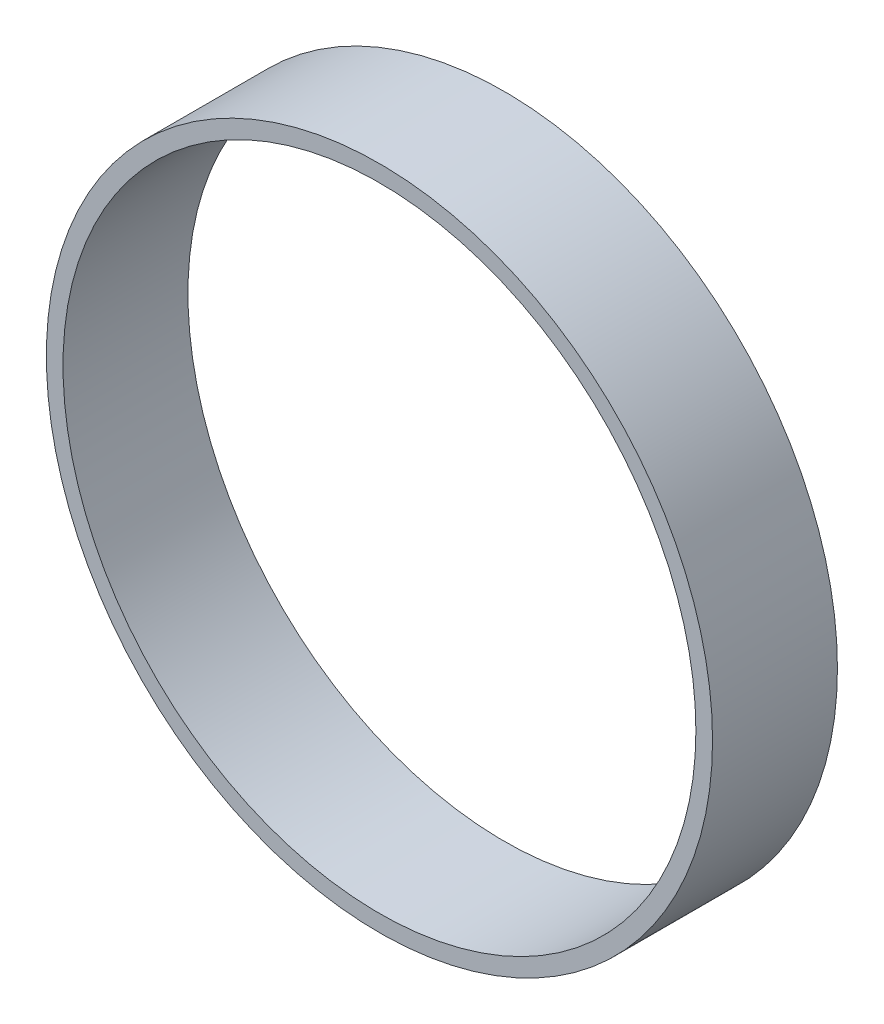
ISO-10303-21;
HEADER;
FILE_DESCRIPTION(('STEP AP214'),'2;1');
FILE_NAME('part.step','',(''),(''),'','','');
FILE_SCHEMA(('AUTOMOTIVE_DESIGN { 1 0 10303 214 1 1 1 1 }'));
ENDSEC;
DATA;
#1=APPLICATION_CONTEXT('core data for automotive mechanical design processes');
#2=APPLICATION_PROTOCOL_DEFINITION('international standard','automotive_design',2000,#1);
#3=PRODUCT_CONTEXT('',#1,'mechanical');
#4=PRODUCT('Part','Part','',(#3));
#5=PRODUCT_RELATED_PRODUCT_CATEGORY('part','',(#4));
#6=PRODUCT_DEFINITION_FORMATION('','',#4);
#7=PRODUCT_DEFINITION_CONTEXT('part definition',#1,'design');
#8=PRODUCT_DEFINITION('design','',#6,#7);
#9=PRODUCT_DEFINITION_SHAPE('','',#8);
#10=(LENGTH_UNIT() NAMED_UNIT(*) SI_UNIT(.MILLI.,.METRE.));
#11=(NAMED_UNIT(*) PLANE_ANGLE_UNIT() SI_UNIT($,.RADIAN.));
#12=(NAMED_UNIT(*) SI_UNIT($,.STERADIAN.) SOLID_ANGLE_UNIT());
#13=UNCERTAINTY_MEASURE_WITH_UNIT(LENGTH_MEASURE(1.E-05),#10,'distance_accuracy_value','');
#14=(GEOMETRIC_REPRESENTATION_CONTEXT(3) GLOBAL_UNCERTAINTY_ASSIGNED_CONTEXT((#13)) GLOBAL_UNIT_ASSIGNED_CONTEXT((#10,
#11,#12)) REPRESENTATION_CONTEXT('',''));
#15=CARTESIAN_POINT('',(0.,0.,0.));
#16=DIRECTION('',(0.,0.,1.));
#17=DIRECTION('',(1.,0.,0.));
#18=AXIS2_PLACEMENT_3D('',#15,#16,#17);
#19=CARTESIAN_POINT('',(1.4210854715202E-11,1.4210854715202E-11,15000.));
#20=DIRECTION('',(0.,0.,1.));
#21=DIRECTION('',(1.,0.,0.));
#22=AXIS2_PLACEMENT_3D('',#19,#20,#21);
#23=PLANE('',#22);
#24=CARTESIAN_POINT('',(1.4210854715202E-11,1.4210854715202E-11,15000.));
#25=DIRECTION('',(0.,0.,1.));
#26=DIRECTION('',(1.,0.,0.));
#27=AXIS2_PLACEMENT_3D('',#24,#25,#26);
#28=CIRCLE('',#27,40000.);
#29=CARTESIAN_POINT('',(40000.,1.4210854715202E-11,15000.));
#30=VERTEX_POINT('',#29);
#31=EDGE_CURVE('E10',#30,#30,#28,.T.);
#32=ORIENTED_EDGE('',*,*,#31,.T.);
#33=EDGE_LOOP('',(#32));
#34=FACE_BOUND('',#33,.T.);
#35=CARTESIAN_POINT('',(1.4210854715202E-11,1.4210854715202E-11,15000.));
#36=DIRECTION('',(0.,0.,1.));
#37=DIRECTION('',(1.,0.,0.));
#38=AXIS2_PLACEMENT_3D('',#35,#36,#37);
#39=CIRCLE('',#38,38000.);
#40=CARTESIAN_POINT('',(38000.,1.4210854715202E-11,15000.));
#41=VERTEX_POINT('',#40);
#42=EDGE_CURVE('E54',#41,#41,#39,.T.);
#43=ORIENTED_EDGE('',*,*,#42,.F.);
#44=EDGE_LOOP('',(#43));
#45=FACE_BOUND('',#44,.T.);
#46=ADVANCED_FACE('F41',(#34,#45),#23,.T.);
#47=CARTESIAN_POINT('',(1.4210854715202E-11,1.4210854715202E-11,0.));
#48=DIRECTION('',(0.,0.,1.));
#49=DIRECTION('',(1.,0.,0.));
#50=AXIS2_PLACEMENT_3D('',#47,#48,#49);
#51=PLANE('',#50);
#52=CARTESIAN_POINT('',(1.4210854715202E-11,1.4210854715202E-11,0.));
#53=DIRECTION('',(0.,0.,1.));
#54=DIRECTION('',(1.,0.,0.));
#55=AXIS2_PLACEMENT_3D('',#52,#53,#54);
#56=CIRCLE('',#55,40000.);
#57=CARTESIAN_POINT('',(40000.,1.4210854715202E-11,0.));
#58=VERTEX_POINT('',#57);
#59=EDGE_CURVE('E45',#58,#58,#56,.T.);
#60=ORIENTED_EDGE('',*,*,#59,.F.);
#61=EDGE_LOOP('',(#60));
#62=FACE_BOUND('',#61,.T.);
#63=CARTESIAN_POINT('',(1.4210854715202E-11,1.4210854715202E-11,0.));
#64=DIRECTION('',(0.,0.,1.));
#65=DIRECTION('',(1.,0.,0.));
#66=AXIS2_PLACEMENT_3D('',#63,#64,#65);
#67=CIRCLE('',#66,38000.);
#68=CARTESIAN_POINT('',(38000.,1.4210854715202E-11,0.));
#69=VERTEX_POINT('',#68);
#70=EDGE_CURVE('E56',#69,#69,#67,.T.);
#71=ORIENTED_EDGE('',*,*,#70,.T.);
#72=EDGE_LOOP('',(#71));
#73=FACE_BOUND('',#72,.T.);
#74=ADVANCED_FACE('F68',(#62,#73),#51,.F.);
#75=CARTESIAN_POINT('',(1.4210854715202E-11,1.4210854715202E-11,15000.));
#76=DIRECTION('',(0.,0.,-1.));
#77=DIRECTION('',(-1.,0.,0.));
#78=AXIS2_PLACEMENT_3D('',#75,#76,#77);
#79=CYLINDRICAL_SURFACE('',#78,40000.);
#80=ORIENTED_EDGE('',*,*,#31,.F.);
#81=EDGE_LOOP('',(#80));
#82=FACE_BOUND('',#81,.T.);
#83=ORIENTED_EDGE('',*,*,#59,.T.);
#84=EDGE_LOOP('',(#83));
#85=FACE_BOUND('',#84,.T.);
#86=ADVANCED_FACE('F43',(#82,#85),#79,.T.);
#87=CARTESIAN_POINT('',(1.4210854715202E-11,1.4210854715202E-11,15000.));
#88=DIRECTION('',(0.,0.,-1.));
#89=DIRECTION('',(-1.,0.,0.));
#90=AXIS2_PLACEMENT_3D('',#87,#88,#89);
#91=CYLINDRICAL_SURFACE('',#90,38000.);
#92=ORIENTED_EDGE('',*,*,#42,.T.);
#93=EDGE_LOOP('',(#92));
#94=FACE_BOUND('',#93,.T.);
#95=ORIENTED_EDGE('',*,*,#70,.F.);
#96=EDGE_LOOP('',(#95));
#97=FACE_BOUND('',#96,.T.);
#98=ADVANCED_FACE('F64',(#94,#97),#91,.F.);
#99=CLOSED_SHELL('',(#46,#74,#86,#98));
#100=MANIFOLD_SOLID_BREP('B2',#99);
#101=ADVANCED_BREP_SHAPE_REPRESENTATION('',(#18,#100),#14);
#102=SHAPE_DEFINITION_REPRESENTATION(#9,#101);
ENDSEC;
END-ISO-10303-21;
